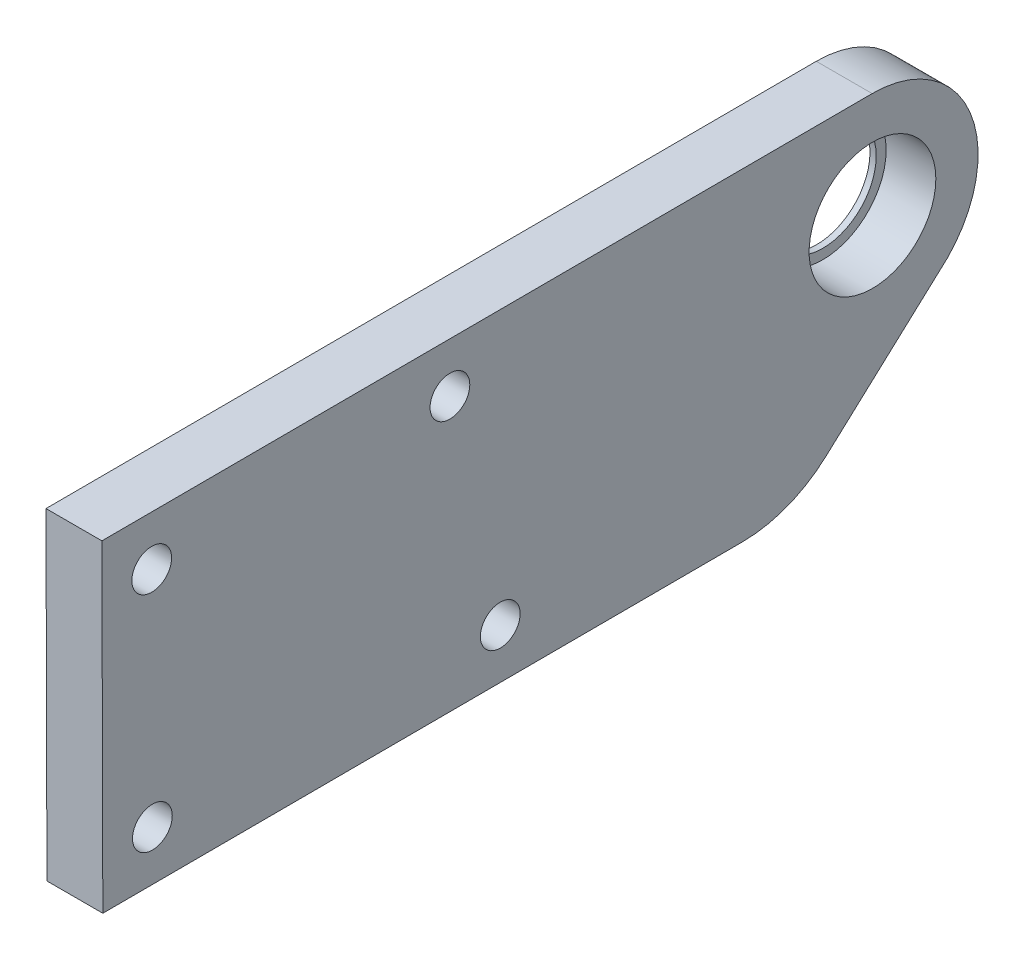
ISO-10303-21;
HEADER;
FILE_DESCRIPTION(('STEP AP214'),'2;1');
FILE_NAME('part.step','',(''),(''),'','','');
FILE_SCHEMA(('AUTOMOTIVE_DESIGN { 1 0 10303 214 1 1 1 1 }'));
ENDSEC;
DATA;
#1=APPLICATION_CONTEXT('core data for automotive mechanical design processes');
#2=APPLICATION_PROTOCOL_DEFINITION('international standard','automotive_design',2000,#1);
#3=PRODUCT_CONTEXT('',#1,'mechanical');
#4=PRODUCT('Part','Part','',(#3));
#5=PRODUCT_RELATED_PRODUCT_CATEGORY('part','',(#4));
#6=PRODUCT_DEFINITION_FORMATION('','',#4);
#7=PRODUCT_DEFINITION_CONTEXT('part definition',#1,'design');
#8=PRODUCT_DEFINITION('design','',#6,#7);
#9=PRODUCT_DEFINITION_SHAPE('','',#8);
#10=(LENGTH_UNIT() NAMED_UNIT(*) SI_UNIT(.MILLI.,.METRE.));
#11=(NAMED_UNIT(*) PLANE_ANGLE_UNIT() SI_UNIT($,.RADIAN.));
#12=(NAMED_UNIT(*) SI_UNIT($,.STERADIAN.) SOLID_ANGLE_UNIT());
#13=UNCERTAINTY_MEASURE_WITH_UNIT(LENGTH_MEASURE(1.E-05),#10,'distance_accuracy_value','');
#14=(GEOMETRIC_REPRESENTATION_CONTEXT(3) GLOBAL_UNCERTAINTY_ASSIGNED_CONTEXT((#13)) GLOBAL_UNIT_ASSIGNED_CONTEXT((#10,
#11,#12)) REPRESENTATION_CONTEXT('',''));
#15=CARTESIAN_POINT('',(0.,0.,0.));
#16=DIRECTION('',(0.,0.,1.));
#17=DIRECTION('',(1.,0.,0.));
#18=AXIS2_PLACEMENT_3D('',#15,#16,#17);
#19=CARTESIAN_POINT('',(4.5,-0.106760715950999,-0.0387879175810517));
#20=DIRECTION('',(-1.,0.,0.));
#21=DIRECTION('',(0.,0.,1.));
#22=AXIS2_PLACEMENT_3D('',#19,#20,#21);
#23=CYLINDRICAL_SURFACE('',#22,4.3);
#24=CARTESIAN_POINT('',(0.,-0.106760715950999,-0.0387879175810517));
#25=DIRECTION('',(1.,0.,0.));
#26=DIRECTION('',(0.,0.,-1.));
#27=AXIS2_PLACEMENT_3D('',#24,#25,#26);
#28=CIRCLE('',#27,4.3);
#29=CARTESIAN_POINT('',(0.,-0.106760715950999,-4.33878791758105));
#30=VERTEX_POINT('',#29);
#31=EDGE_CURVE('E126',#30,#30,#28,.T.);
#32=ORIENTED_EDGE('',*,*,#31,.F.);
#33=EDGE_LOOP('',(#32));
#34=FACE_BOUND('',#33,.T.);
#35=CARTESIAN_POINT('',(0.5,-0.106760715950999,-0.0387879175810517));
#36=DIRECTION('',(1.,0.,0.));
#37=DIRECTION('',(0.,0.,-1.));
#38=AXIS2_PLACEMENT_3D('',#35,#36,#37);
#39=CIRCLE('',#38,4.3);
#40=CARTESIAN_POINT('',(0.5,-0.106760715950999,-4.33878791758105));
#41=VERTEX_POINT('',#40);
#42=EDGE_CURVE('E39',#41,#41,#39,.T.);
#43=ORIENTED_EDGE('',*,*,#42,.T.);
#44=EDGE_LOOP('',(#43));
#45=FACE_BOUND('',#44,.T.);
#46=ADVANCED_FACE('F35',(#34,#45),#23,.F.);
#47=CARTESIAN_POINT('',(4.5,-0.106760715950999,-0.0387879175810517));
#48=DIRECTION('',(1.,0.,0.));
#49=DIRECTION('',(0.,0.,-1.));
#50=AXIS2_PLACEMENT_3D('',#47,#48,#49);
#51=PLANE('',#50);
#52=CARTESIAN_POINT('',(4.5,-0.106760715950999,-0.0387879175810517));
#53=DIRECTION('',(1.,0.,0.));
#54=DIRECTION('',(0.,0.,-1.));
#55=AXIS2_PLACEMENT_3D('',#52,#53,#54);
#56=CIRCLE('',#55,5.1);
#57=CARTESIAN_POINT('',(4.5,-0.106760715950999,-5.13878791758105));
#58=VERTEX_POINT('',#57);
#59=EDGE_CURVE('E273',#58,#58,#56,.T.);
#60=ORIENTED_EDGE('',*,*,#59,.F.);
#61=EDGE_LOOP('',(#60));
#62=FACE_BOUND('',#61,.T.);
#63=CARTESIAN_POINT('',(4.5,-13.7733767562103,57.9221783097702));
#64=DIRECTION('',(1.,0.,0.));
#65=DIRECTION('',(0.,0.,-1.));
#66=AXIS2_PLACEMENT_3D('',#63,#64,#65);
#67=CIRCLE('',#66,1.59999999999998);
#68=CARTESIAN_POINT('',(4.5,-13.7733767562103,56.3221783097702));
#69=VERTEX_POINT('',#68);
#70=EDGE_CURVE('E285',#69,#69,#67,.T.);
#71=ORIENTED_EDGE('',*,*,#70,.F.);
#72=EDGE_LOOP('',(#71));
#73=FACE_BOUND('',#72,.T.);
#74=CARTESIAN_POINT('',(4.5,4.22654892278509,57.9739040349113));
#75=DIRECTION('',(1.,0.,0.));
#76=DIRECTION('',(0.,0.,-1.));
#77=AXIS2_PLACEMENT_3D('',#74,#75,#76);
#78=CIRCLE('',#77,1.60000000000002);
#79=CARTESIAN_POINT('',(4.5,4.22654892278509,56.3739040349113));
#80=VERTEX_POINT('',#79);
#81=EDGE_CURVE('E297',#80,#80,#78,.T.);
#82=ORIENTED_EDGE('',*,*,#81,.F.);
#83=EDGE_LOOP('',(#82));
#84=FACE_BOUND('',#83,.T.);
#85=DIRECTION('',(0.,-0.00287365139677191,0.999995871055301));
#86=VECTOR('',#85,1.);
#87=CARTESIAN_POINT('',(4.5,8.21503780141921,61.9853821247201));
#88=LINE('',#87,#86);
#89=CARTESIAN_POINT('',(4.5,8.39320418801906,-0.0143618807086011));
#90=VERTEX_POINT('',#89);
#91=CARTESIAN_POINT('',(4.5,8.21503780141921,61.9853821247201));
#92=VERTEX_POINT('',#91);
#93=EDGE_CURVE('E133',#90,#92,#88,.T.);
#94=ORIENTED_EDGE('',*,*,#93,.T.);
#95=DIRECTION('',(0.,-0.999995871055301,-0.00287365139675991));
#96=VECTOR('',#95,1.);
#97=CARTESIAN_POINT('',(4.5,8.21503780141921,61.9853821247201));
#98=LINE('',#97,#96);
#99=CARTESIAN_POINT('',(4.5,-17.7848548460186,61.9106671884043));
#100=VERTEX_POINT('',#99);
#101=EDGE_CURVE('E90',#92,#100,#98,.T.);
#102=ORIENTED_EDGE('',*,*,#101,.T.);
#103=DIRECTION('',(0.,0.002873651396772,-0.999995871055301));
#104=VECTOR('',#103,1.);
#105=CARTESIAN_POINT('',(4.5,-17.7848548460186,61.9106671884043));
#106=LINE('',#105,#104);
#107=CARTESIAN_POINT('',(4.5,-17.6368617990849,10.4108798290563));
#108=VERTEX_POINT('',#107);
#109=EDGE_CURVE('E104',#100,#108,#106,.T.);
#110=ORIENTED_EDGE('',*,*,#109,.T.);
#111=CARTESIAN_POINT('',(4.5,-7.63690308853195,10.439616343024));
#112=DIRECTION('',(1.,0.,0.));
#113=DIRECTION('',(0.,0.,-1.));
#114=AXIS2_PLACEMENT_3D('',#111,#112,#113);
#115=CIRCLE('',#114,9.99999999999991);
#116=CARTESIAN_POINT('',(4.5,-15.0193601103393,3.69429734973951));
#117=VERTEX_POINT('',#116);
#118=EDGE_CURVE('E97',#108,#117,#115,.T.);
#119=ORIENTED_EDGE('',*,*,#118,.T.);
#120=DIRECTION('',(0.,0.674531899328458,-0.738245702180746));
#121=VECTOR('',#120,1.);
#122=CARTESIAN_POINT('',(4.5,-15.0193601103393,3.6942973497395));
#123=LINE('',#122,#121);
#124=CARTESIAN_POINT('',(4.5,-6.11262214246682,-6.05373833512312));
#125=VERTEX_POINT('',#124);
#126=EDGE_CURVE('E102',#117,#125,#123,.T.);
#127=ORIENTED_EDGE('',*,*,#126,.T.);
#128=CARTESIAN_POINT('',(4.5,-0.106760715950999,-0.0387879175810517));
#129=DIRECTION('',(1.,0.,0.));
#130=DIRECTION('',(0.,0.,-1.));
#131=AXIS2_PLACEMENT_3D('',#128,#129,#130);
#132=CIRCLE('',#131,8.50000000000001);
#133=EDGE_CURVE('E53',#125,#90,#132,.T.);
#134=ORIENTED_EDGE('',*,*,#133,.T.);
#135=EDGE_LOOP('',(#94,#102,#110,#119,#127,#134));
#136=FACE_BOUND('',#135,.T.);
#137=CARTESIAN_POINT('',(4.5,4.29551655630707,33.9740031295841));
#138=DIRECTION('',(1.,0.,0.));
#139=DIRECTION('',(0.,0.,-1.));
#140=AXIS2_PLACEMENT_3D('',#137,#138,#139);
#141=CIRCLE('',#140,1.60000000000002);
#142=CARTESIAN_POINT('',(4.5,4.29551655630707,32.3740031295841));
#143=VERTEX_POINT('',#142);
#144=EDGE_CURVE('E291',#143,#143,#141,.T.);
#145=ORIENTED_EDGE('',*,*,#144,.F.);
#146=EDGE_LOOP('',(#145));
#147=FACE_BOUND('',#146,.T.);
#148=CARTESIAN_POINT('',(4.5,-13.6929145171007,29.9222939202218));
#149=DIRECTION('',(1.,0.,0.));
#150=DIRECTION('',(0.,0.,-1.));
#151=AXIS2_PLACEMENT_3D('',#148,#149,#150);
#152=CIRCLE('',#151,1.59999999999999);
#153=CARTESIAN_POINT('',(4.5,-13.6929145171007,28.3222939202218));
#154=VERTEX_POINT('',#153);
#155=EDGE_CURVE('E279',#154,#154,#152,.T.);
#156=ORIENTED_EDGE('',*,*,#155,.F.);
#157=EDGE_LOOP('',(#156));
#158=FACE_BOUND('',#157,.T.);
#159=ADVANCED_FACE('F99',(#62,#73,#84,#136,#147,#158),#51,.T.);
#160=CARTESIAN_POINT('',(0.,-0.106760715950999,-0.0387879175810517));
#161=DIRECTION('',(1.,0.,0.));
#162=DIRECTION('',(0.,0.,-1.));
#163=AXIS2_PLACEMENT_3D('',#160,#161,#162);
#164=PLANE('',#163);
#165=DIRECTION('',(0.,-0.00287365139677191,0.999995871055301));
#166=VECTOR('',#165,1.);
#167=CARTESIAN_POINT('',(0.,8.21503780141921,61.9853821247201));
#168=LINE('',#167,#166);
#169=CARTESIAN_POINT('',(0.,8.39320418801906,-0.0143618807086011));
#170=VERTEX_POINT('',#169);
#171=CARTESIAN_POINT('',(0.,8.21503780141921,61.9853821247201));
#172=VERTEX_POINT('',#171);
#173=EDGE_CURVE('E122',#170,#172,#168,.T.);
#174=ORIENTED_EDGE('',*,*,#173,.F.);
#175=CARTESIAN_POINT('',(0.,-0.106760715950999,-0.0387879175810517));
#176=DIRECTION('',(1.,0.,0.));
#177=DIRECTION('',(0.,0.,-1.));
#178=AXIS2_PLACEMENT_3D('',#175,#176,#177);
#179=CIRCLE('',#178,8.50000000000001);
#180=CARTESIAN_POINT('',(0.,-6.11262214246682,-6.05373833512312));
#181=VERTEX_POINT('',#180);
#182=EDGE_CURVE('E82',#181,#170,#179,.T.);
#183=ORIENTED_EDGE('',*,*,#182,.F.);
#184=DIRECTION('',(0.,0.674531899328458,-0.738245702180746));
#185=VECTOR('',#184,1.);
#186=CARTESIAN_POINT('',(0.,-15.0193601103393,3.6942973497395));
#187=LINE('',#186,#185);
#188=CARTESIAN_POINT('',(0.,-15.0193601103393,3.69429734973951));
#189=VERTEX_POINT('',#188);
#190=EDGE_CURVE('E76',#189,#181,#187,.T.);
#191=ORIENTED_EDGE('',*,*,#190,.F.);
#192=CARTESIAN_POINT('',(0.,-7.63690308853195,10.439616343024));
#193=DIRECTION('',(1.,0.,0.));
#194=DIRECTION('',(0.,0.,-1.));
#195=AXIS2_PLACEMENT_3D('',#192,#193,#194);
#196=CIRCLE('',#195,9.99999999999991);
#197=CARTESIAN_POINT('',(0.,-17.6368617990849,10.4108798290563));
#198=VERTEX_POINT('',#197);
#199=EDGE_CURVE('E112',#198,#189,#196,.T.);
#200=ORIENTED_EDGE('',*,*,#199,.F.);
#201=DIRECTION('',(0.,0.002873651396772,-0.999995871055301));
#202=VECTOR('',#201,1.);
#203=CARTESIAN_POINT('',(0.,-17.7848548460186,61.9106671884043));
#204=LINE('',#203,#202);
#205=CARTESIAN_POINT('',(0.,-17.7848548460186,61.9106671884043));
#206=VERTEX_POINT('',#205);
#207=EDGE_CURVE('E128',#206,#198,#204,.T.);
#208=ORIENTED_EDGE('',*,*,#207,.F.);
#209=DIRECTION('',(0.,-0.999995871055301,-0.00287365139675991));
#210=VECTOR('',#209,1.);
#211=CARTESIAN_POINT('',(0.,8.21503780141921,61.9853821247201));
#212=LINE('',#211,#210);
#213=EDGE_CURVE('E125',#172,#206,#212,.T.);
#214=ORIENTED_EDGE('',*,*,#213,.F.);
#215=EDGE_LOOP('',(#174,#183,#191,#200,#208,#214));
#216=FACE_BOUND('',#215,.T.);
#217=ORIENTED_EDGE('',*,*,#31,.T.);
#218=EDGE_LOOP('',(#217));
#219=FACE_BOUND('',#218,.T.);
#220=CARTESIAN_POINT('',(0.,4.22654892278509,57.9739040349113));
#221=DIRECTION('',(1.,0.,0.));
#222=DIRECTION('',(0.,0.,-1.));
#223=AXIS2_PLACEMENT_3D('',#220,#221,#222);
#224=CIRCLE('',#223,1.60000000000002);
#225=CARTESIAN_POINT('',(0.,4.22654892278509,56.3739040349113));
#226=VERTEX_POINT('',#225);
#227=EDGE_CURVE('E294',#226,#226,#224,.T.);
#228=ORIENTED_EDGE('',*,*,#227,.T.);
#229=EDGE_LOOP('',(#228));
#230=FACE_BOUND('',#229,.T.);
#231=CARTESIAN_POINT('',(0.,4.29551655630707,33.9740031295841));
#232=DIRECTION('',(1.,0.,0.));
#233=DIRECTION('',(0.,0.,-1.));
#234=AXIS2_PLACEMENT_3D('',#231,#232,#233);
#235=CIRCLE('',#234,1.60000000000002);
#236=CARTESIAN_POINT('',(0.,4.29551655630707,32.3740031295841));
#237=VERTEX_POINT('',#236);
#238=EDGE_CURVE('E288',#237,#237,#235,.T.);
#239=ORIENTED_EDGE('',*,*,#238,.T.);
#240=EDGE_LOOP('',(#239));
#241=FACE_BOUND('',#240,.T.);
#242=CARTESIAN_POINT('',(0.,-13.7733767562103,57.9221783097702));
#243=DIRECTION('',(1.,0.,0.));
#244=DIRECTION('',(0.,0.,-1.));
#245=AXIS2_PLACEMENT_3D('',#242,#243,#244);
#246=CIRCLE('',#245,1.59999999999998);
#247=CARTESIAN_POINT('',(0.,-13.7733767562103,56.3221783097702));
#248=VERTEX_POINT('',#247);
#249=EDGE_CURVE('E282',#248,#248,#246,.T.);
#250=ORIENTED_EDGE('',*,*,#249,.T.);
#251=EDGE_LOOP('',(#250));
#252=FACE_BOUND('',#251,.T.);
#253=CARTESIAN_POINT('',(0.,-13.6929145171007,29.9222939202218));
#254=DIRECTION('',(1.,0.,0.));
#255=DIRECTION('',(0.,0.,-1.));
#256=AXIS2_PLACEMENT_3D('',#253,#254,#255);
#257=CIRCLE('',#256,1.59999999999999);
#258=CARTESIAN_POINT('',(0.,-13.6929145171007,28.3222939202218));
#259=VERTEX_POINT('',#258);
#260=EDGE_CURVE('E275',#259,#259,#257,.T.);
#261=ORIENTED_EDGE('',*,*,#260,.T.);
#262=EDGE_LOOP('',(#261));
#263=FACE_BOUND('',#262,.T.);
#264=ADVANCED_FACE('F143',(#216,#219,#230,#241,#252,#263),#164,.F.);
#265=CARTESIAN_POINT('',(4.5,8.21503780141921,61.9853821247201));
#266=DIRECTION('',(0.,-0.999995871055301,-0.00287365139677191));
#267=DIRECTION('',(0.,0.00287365139677191,-0.999995871055301));
#268=AXIS2_PLACEMENT_3D('',#265,#266,#267);
#269=PLANE('',#268);
#270=ORIENTED_EDGE('',*,*,#173,.T.);
#271=DIRECTION('',(-1.,0.,0.));
#272=VECTOR('',#271,1.);
#273=CARTESIAN_POINT('',(4.5,8.21503780141921,61.9853821247201));
#274=LINE('',#273,#272);
#275=EDGE_CURVE('E11',#92,#172,#274,.T.);
#276=ORIENTED_EDGE('',*,*,#275,.F.);
#277=ORIENTED_EDGE('',*,*,#93,.F.);
#278=DIRECTION('',(-1.,0.,0.));
#279=VECTOR('',#278,1.);
#280=CARTESIAN_POINT('',(4.5,8.39320418801906,-0.0143618807086011));
#281=LINE('',#280,#279);
#282=EDGE_CURVE('E118',#90,#170,#281,.T.);
#283=ORIENTED_EDGE('',*,*,#282,.T.);
#284=EDGE_LOOP('',(#270,#276,#277,#283));
#285=FACE_BOUND('',#284,.T.);
#286=ADVANCED_FACE('F37',(#285),#269,.F.);
#287=CARTESIAN_POINT('',(4.5,8.21503780141921,61.9853821247201));
#288=DIRECTION('',(0.,0.00287365139675991,-0.999995871055301));
#289=DIRECTION('',(0.,0.999995871055301,0.00287365139675991));
#290=AXIS2_PLACEMENT_3D('',#287,#288,#289);
#291=PLANE('',#290);
#292=ORIENTED_EDGE('',*,*,#213,.T.);
#293=DIRECTION('',(-1.,0.,0.));
#294=VECTOR('',#293,1.);
#295=CARTESIAN_POINT('',(4.5,-17.7848548460186,61.9106671884043));
#296=LINE('',#295,#294);
#297=EDGE_CURVE('E45',#100,#206,#296,.T.);
#298=ORIENTED_EDGE('',*,*,#297,.F.);
#299=ORIENTED_EDGE('',*,*,#101,.F.);
#300=ORIENTED_EDGE('',*,*,#275,.T.);
#301=EDGE_LOOP('',(#292,#298,#299,#300));
#302=FACE_BOUND('',#301,.T.);
#303=ADVANCED_FACE('F176',(#302),#291,.F.);
#304=CARTESIAN_POINT('',(4.5,-17.7848548460186,61.9106671884043));
#305=DIRECTION('',(0.,0.999995871055301,0.002873651396772));
#306=DIRECTION('',(0.,-0.002873651396772,0.999995871055301));
#307=AXIS2_PLACEMENT_3D('',#304,#305,#306);
#308=PLANE('',#307);
#309=ORIENTED_EDGE('',*,*,#207,.T.);
#310=DIRECTION('',(-1.,0.,0.));
#311=VECTOR('',#310,1.);
#312=CARTESIAN_POINT('',(4.5,-17.6368617990849,10.4108798290563));
#313=LINE('',#312,#311);
#314=EDGE_CURVE('E113',#108,#198,#313,.T.);
#315=ORIENTED_EDGE('',*,*,#314,.F.);
#316=ORIENTED_EDGE('',*,*,#109,.F.);
#317=ORIENTED_EDGE('',*,*,#297,.T.);
#318=EDGE_LOOP('',(#309,#315,#316,#317));
#319=FACE_BOUND('',#318,.T.);
#320=ADVANCED_FACE('F140',(#319),#308,.F.);
#321=CARTESIAN_POINT('',(4.5,-7.63690308853195,10.439616343024));
#322=DIRECTION('',(-1.,0.,0.));
#323=DIRECTION('',(0.,0.,1.));
#324=AXIS2_PLACEMENT_3D('',#321,#322,#323);
#325=CYLINDRICAL_SURFACE('',#324,9.99999999999991);
#326=ORIENTED_EDGE('',*,*,#199,.T.);
#327=DIRECTION('',(-1.,0.,0.));
#328=VECTOR('',#327,1.);
#329=CARTESIAN_POINT('',(4.5,-15.0193601103393,3.69429734973951));
#330=LINE('',#329,#328);
#331=EDGE_CURVE('E109',#117,#189,#330,.T.);
#332=ORIENTED_EDGE('',*,*,#331,.F.);
#333=ORIENTED_EDGE('',*,*,#118,.F.);
#334=ORIENTED_EDGE('',*,*,#314,.T.);
#335=EDGE_LOOP('',(#326,#332,#333,#334));
#336=FACE_BOUND('',#335,.T.);
#337=ADVANCED_FACE('F110',(#336),#325,.T.);
#338=CARTESIAN_POINT('',(4.5,-15.0193601103393,3.6942973497395));
#339=DIRECTION('',(0.,0.738245702180746,0.674531899328458));
#340=DIRECTION('',(0.,-0.674531899328458,0.738245702180746));
#341=AXIS2_PLACEMENT_3D('',#338,#339,#340);
#342=PLANE('',#341);
#343=ORIENTED_EDGE('',*,*,#190,.T.);
#344=DIRECTION('',(-1.,0.,0.));
#345=VECTOR('',#344,1.);
#346=CARTESIAN_POINT('',(4.5,-6.11262214246682,-6.05373833512312));
#347=LINE('',#346,#345);
#348=EDGE_CURVE('E114',#125,#181,#347,.T.);
#349=ORIENTED_EDGE('',*,*,#348,.F.);
#350=ORIENTED_EDGE('',*,*,#126,.F.);
#351=ORIENTED_EDGE('',*,*,#331,.T.);
#352=EDGE_LOOP('',(#343,#349,#350,#351));
#353=FACE_BOUND('',#352,.T.);
#354=ADVANCED_FACE('F116',(#353),#342,.F.);
#355=CARTESIAN_POINT('',(4.5,-0.106760715950999,-0.0387879175810517));
#356=DIRECTION('',(-1.,0.,0.));
#357=DIRECTION('',(0.,0.,1.));
#358=AXIS2_PLACEMENT_3D('',#355,#356,#357);
#359=CYLINDRICAL_SURFACE('',#358,8.50000000000001);
#360=ORIENTED_EDGE('',*,*,#182,.T.);
#361=ORIENTED_EDGE('',*,*,#282,.F.);
#362=ORIENTED_EDGE('',*,*,#133,.F.);
#363=ORIENTED_EDGE('',*,*,#348,.T.);
#364=EDGE_LOOP('',(#360,#361,#362,#363));
#365=FACE_BOUND('',#364,.T.);
#366=ADVANCED_FACE('F148',(#365),#359,.T.);
#367=CARTESIAN_POINT('',(4.5,4.22654892278509,57.9739040349113));
#368=DIRECTION('',(-1.,0.,0.));
#369=DIRECTION('',(0.,0.,1.));
#370=AXIS2_PLACEMENT_3D('',#367,#368,#369);
#371=CYLINDRICAL_SURFACE('',#370,1.60000000000002);
#372=ORIENTED_EDGE('',*,*,#81,.T.);
#373=EDGE_LOOP('',(#372));
#374=FACE_BOUND('',#373,.T.);
#375=ORIENTED_EDGE('',*,*,#227,.F.);
#376=EDGE_LOOP('',(#375));
#377=FACE_BOUND('',#376,.T.);
#378=ADVANCED_FACE('F150',(#374,#377),#371,.F.);
#379=CARTESIAN_POINT('',(4.5,4.29551655630707,33.9740031295841));
#380=DIRECTION('',(-1.,0.,0.));
#381=DIRECTION('',(0.,0.,1.));
#382=AXIS2_PLACEMENT_3D('',#379,#380,#381);
#383=CYLINDRICAL_SURFACE('',#382,1.60000000000002);
#384=ORIENTED_EDGE('',*,*,#144,.T.);
#385=EDGE_LOOP('',(#384));
#386=FACE_BOUND('',#385,.T.);
#387=ORIENTED_EDGE('',*,*,#238,.F.);
#388=EDGE_LOOP('',(#387));
#389=FACE_BOUND('',#388,.T.);
#390=ADVANCED_FACE('F156',(#386,#389),#383,.F.);
#391=CARTESIAN_POINT('',(4.5,-13.7733767562103,57.9221783097702));
#392=DIRECTION('',(-1.,0.,0.));
#393=DIRECTION('',(0.,0.,1.));
#394=AXIS2_PLACEMENT_3D('',#391,#392,#393);
#395=CYLINDRICAL_SURFACE('',#394,1.59999999999998);
#396=ORIENTED_EDGE('',*,*,#70,.T.);
#397=EDGE_LOOP('',(#396));
#398=FACE_BOUND('',#397,.T.);
#399=ORIENTED_EDGE('',*,*,#249,.F.);
#400=EDGE_LOOP('',(#399));
#401=FACE_BOUND('',#400,.T.);
#402=ADVANCED_FACE('F213',(#398,#401),#395,.F.);
#403=CARTESIAN_POINT('',(4.5,-13.6929145171007,29.9222939202218));
#404=DIRECTION('',(-1.,0.,0.));
#405=DIRECTION('',(0.,0.,1.));
#406=AXIS2_PLACEMENT_3D('',#403,#404,#405);
#407=CYLINDRICAL_SURFACE('',#406,1.59999999999999);
#408=ORIENTED_EDGE('',*,*,#155,.T.);
#409=EDGE_LOOP('',(#408));
#410=FACE_BOUND('',#409,.T.);
#411=ORIENTED_EDGE('',*,*,#260,.F.);
#412=EDGE_LOOP('',(#411));
#413=FACE_BOUND('',#412,.T.);
#414=ADVANCED_FACE('F222',(#410,#413),#407,.F.);
#415=CARTESIAN_POINT('',(0.5,-0.106760715950999,-0.0387879175810517));
#416=DIRECTION('',(1.,0.,0.));
#417=DIRECTION('',(0.,0.,-1.));
#418=AXIS2_PLACEMENT_3D('',#415,#416,#417);
#419=CYLINDRICAL_SURFACE('',#418,5.1);
#420=CARTESIAN_POINT('',(0.5,-0.106760715950999,-0.0387879175810517));
#421=DIRECTION('',(1.,0.,0.));
#422=DIRECTION('',(0.,0.,-1.));
#423=AXIS2_PLACEMENT_3D('',#420,#421,#422);
#424=CIRCLE('',#423,5.1);
#425=CARTESIAN_POINT('',(0.5,-0.106760715950999,-5.13878791758105));
#426=VERTEX_POINT('',#425);
#427=EDGE_CURVE('E272',#426,#426,#424,.T.);
#428=ORIENTED_EDGE('',*,*,#427,.F.);
#429=EDGE_LOOP('',(#428));
#430=FACE_BOUND('',#429,.T.);
#431=ORIENTED_EDGE('',*,*,#59,.T.);
#432=EDGE_LOOP('',(#431));
#433=FACE_BOUND('',#432,.T.);
#434=ADVANCED_FACE('F231',(#430,#433),#419,.F.);
#435=CARTESIAN_POINT('',(0.5,-0.106760715950999,-0.0387879175810517));
#436=DIRECTION('',(1.,0.,0.));
#437=DIRECTION('',(0.,0.,-1.));
#438=AXIS2_PLACEMENT_3D('',#435,#436,#437);
#439=PLANE('',#438);
#440=ORIENTED_EDGE('',*,*,#42,.F.);
#441=EDGE_LOOP('',(#440));
#442=FACE_BOUND('',#441,.T.);
#443=ORIENTED_EDGE('',*,*,#427,.T.);
#444=EDGE_LOOP('',(#443));
#445=FACE_BOUND('',#444,.T.);
#446=ADVANCED_FACE('F253',(#442,#445),#439,.T.);
#447=CLOSED_SHELL('',(#46,#159,#264,#286,#303,#320,#337,#354,#366,#378,#390,#402,#414,#434,#446));
#448=MANIFOLD_SOLID_BREP('B2',#447);
#449=ADVANCED_BREP_SHAPE_REPRESENTATION('',(#18,#448),#14);
#450=SHAPE_DEFINITION_REPRESENTATION(#9,#449);
ENDSEC;
END-ISO-10303-21;
